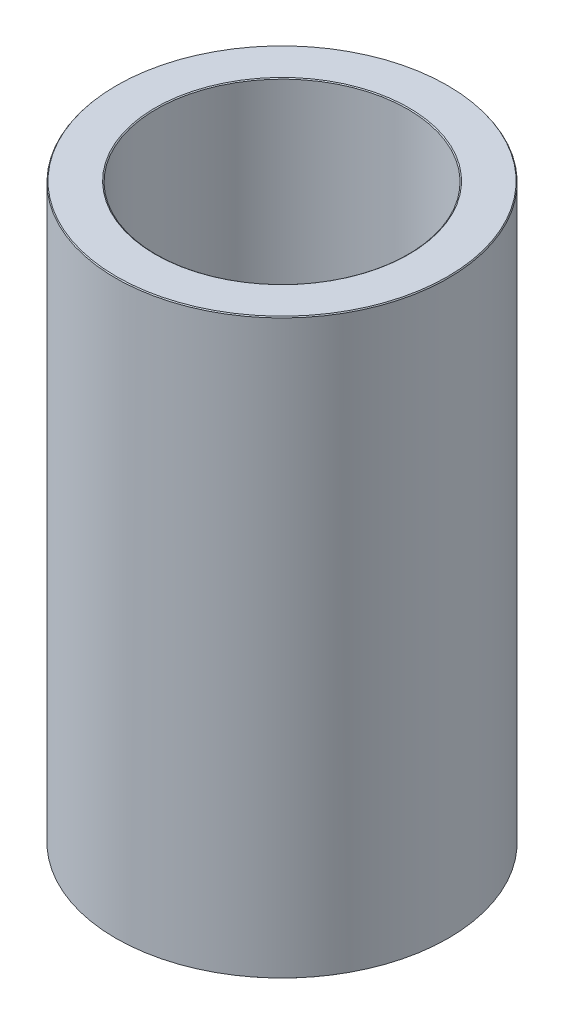
ISO-10303-21;
HEADER;
FILE_DESCRIPTION(('STEP AP214'),'2;1');
FILE_NAME('part.step','',(''),(''),'','','');
FILE_SCHEMA(('AUTOMOTIVE_DESIGN { 1 0 10303 214 1 1 1 1 }'));
ENDSEC;
DATA;
#1=APPLICATION_CONTEXT('core data for automotive mechanical design processes');
#2=APPLICATION_PROTOCOL_DEFINITION('international standard','automotive_design',2000,#1);
#3=PRODUCT_CONTEXT('',#1,'mechanical');
#4=PRODUCT('Part','Part','',(#3));
#5=PRODUCT_RELATED_PRODUCT_CATEGORY('part','',(#4));
#6=PRODUCT_DEFINITION_FORMATION('','',#4);
#7=PRODUCT_DEFINITION_CONTEXT('part definition',#1,'design');
#8=PRODUCT_DEFINITION('design','',#6,#7);
#9=PRODUCT_DEFINITION_SHAPE('','',#8);
#10=(LENGTH_UNIT() NAMED_UNIT(*) SI_UNIT(.MILLI.,.METRE.));
#11=(NAMED_UNIT(*) PLANE_ANGLE_UNIT() SI_UNIT($,.RADIAN.));
#12=(NAMED_UNIT(*) SI_UNIT($,.STERADIAN.) SOLID_ANGLE_UNIT());
#13=UNCERTAINTY_MEASURE_WITH_UNIT(LENGTH_MEASURE(1.E-05),#10,'distance_accuracy_value','');
#14=(GEOMETRIC_REPRESENTATION_CONTEXT(3) GLOBAL_UNCERTAINTY_ASSIGNED_CONTEXT((#13)) GLOBAL_UNIT_ASSIGNED_CONTEXT((#10,
#11,#12)) REPRESENTATION_CONTEXT('',''));
#15=CARTESIAN_POINT('',(0.,0.,0.));
#16=DIRECTION('',(0.,0.,1.));
#17=DIRECTION('',(1.,0.,0.));
#18=AXIS2_PLACEMENT_3D('',#15,#16,#17);
#19=CARTESIAN_POINT('',(0.,198.304315310757,0.));
#20=DIRECTION('',(0.,-1.,0.));
#21=DIRECTION('',(0.,0.,-1.));
#22=AXIS2_PLACEMENT_3D('',#19,#20,#21);
#23=CYLINDRICAL_SURFACE('',#22,57.5);
#24=CARTESIAN_POINT('',(0.,0.254148228722828,0.));
#25=DIRECTION('',(0.,1.,0.));
#26=DIRECTION('',(0.,0.,1.));
#27=AXIS2_PLACEMENT_3D('',#24,#25,#26);
#28=CIRCLE('',#27,57.5);
#29=CARTESIAN_POINT('',(0.,0.2541482287228,-57.5));
#30=VERTEX_POINT('',#29);
#31=EDGE_CURVE('E10',#30,#30,#28,.T.);
#32=CARTESIAN_POINT('',(0.,197.946111651441,0.));
#33=DIRECTION('',(0.,1.,0.));
#34=DIRECTION('',(0.,0.,1.));
#35=AXIS2_PLACEMENT_3D('',#32,#33,#34);
#36=CIRCLE('',#35,57.5);
#37=CARTESIAN_POINT('',(0.,197.946111651441,-57.5));
#38=VERTEX_POINT('',#37);
#39=EDGE_CURVE('E50',#38,#38,#36,.F.);
#40=CARTESIAN_POINT('',(0.,0.2541482287228,-57.5));
#41=CARTESIAN_POINT('',(0.,2.3134395143761,-57.5));
#42=CARTESIAN_POINT('',(0.,4.37273080002941,-57.5));
#43=CARTESIAN_POINT('',(0.,8.49131337133604,-57.5));
#44=CARTESIAN_POINT('',(0.,10.5506046569894,-57.5));
#45=CARTESIAN_POINT('',(0.,14.669187228296,-57.5));
#46=CARTESIAN_POINT('',(0.,16.7284785139493,-57.5));
#47=CARTESIAN_POINT('',(0.,20.8470610852559,-57.5));
#48=CARTESIAN_POINT('',(0.,22.9063523709092,-57.5));
#49=CARTESIAN_POINT('',(0.,27.0249349422158,-57.5));
#50=CARTESIAN_POINT('',(0.,29.0842262278691,-57.5));
#51=CARTESIAN_POINT('',(0.,33.2028087991758,-57.5));
#52=CARTESIAN_POINT('',(0.,35.2621000848291,-57.5));
#53=CARTESIAN_POINT('',(0.,39.3806826561357,-57.5));
#54=CARTESIAN_POINT('',(0.,41.439973941789,-57.5));
#55=CARTESIAN_POINT('',(0.,45.5585565130956,-57.5));
#56=CARTESIAN_POINT('',(0.,47.6178477987489,-57.5));
#57=CARTESIAN_POINT('',(0.,51.7364303700556,-57.5));
#58=CARTESIAN_POINT('',(0.,53.7957216557089,-57.5));
#59=CARTESIAN_POINT('',(0.,57.9143042270155,-57.5));
#60=CARTESIAN_POINT('',(0.,59.9735955126688,-57.5));
#61=CARTESIAN_POINT('',(0.,64.0921780839754,-57.5));
#62=CARTESIAN_POINT('',(0.,66.1514693696287,-57.5));
#63=CARTESIAN_POINT('',(0.,70.2700519409353,-57.5));
#64=CARTESIAN_POINT('',(0.,72.3293432265886,-57.5));
#65=CARTESIAN_POINT('',(0.,76.4479257978953,-57.5));
#66=CARTESIAN_POINT('',(0.,78.5072170835486,-57.5));
#67=CARTESIAN_POINT('',(0.,82.6257996548552,-57.5));
#68=CARTESIAN_POINT('',(0.,84.6850909405085,-57.5));
#69=CARTESIAN_POINT('',(0.,88.8036735118151,-57.5));
#70=CARTESIAN_POINT('',(0.,90.8629647974684,-57.5));
#71=CARTESIAN_POINT('',(0.,94.981547368775,-57.5));
#72=CARTESIAN_POINT('',(0.,97.0408386544284,-57.5));
#73=CARTESIAN_POINT('',(0.,101.159421225735,-57.5));
#74=CARTESIAN_POINT('',(0.,103.218712511388,-57.5));
#75=CARTESIAN_POINT('',(0.,107.337295082695,-57.5));
#76=CARTESIAN_POINT('',(0.,109.396586368348,-57.5));
#77=CARTESIAN_POINT('',(0.,113.515168939655,-57.5));
#78=CARTESIAN_POINT('',(0.,115.574460225308,-57.5));
#79=CARTESIAN_POINT('',(0.,119.693042796615,-57.5));
#80=CARTESIAN_POINT('',(0.,121.752334082268,-57.5));
#81=CARTESIAN_POINT('',(0.,125.870916653575,-57.5));
#82=CARTESIAN_POINT('',(0.,127.930207939228,-57.5));
#83=CARTESIAN_POINT('',(0.,132.048790510535,-57.5));
#84=CARTESIAN_POINT('',(0.,134.108081796188,-57.5));
#85=CARTESIAN_POINT('',(0.,138.226664367495,-57.5));
#86=CARTESIAN_POINT('',(0.,140.285955653148,-57.5));
#87=CARTESIAN_POINT('',(0.,144.404538224454,-57.5));
#88=CARTESIAN_POINT('',(0.,146.463829510108,-57.5));
#89=CARTESIAN_POINT('',(0.,150.582412081414,-57.5));
#90=CARTESIAN_POINT('',(0.,152.641703367068,-57.5));
#91=CARTESIAN_POINT('',(0.,156.760285938374,-57.5));
#92=CARTESIAN_POINT('',(0.,158.819577224028,-57.5));
#93=CARTESIAN_POINT('',(0.,162.938159795334,-57.5));
#94=CARTESIAN_POINT('',(0.,164.997451080988,-57.5));
#95=CARTESIAN_POINT('',(0.,169.116033652294,-57.5));
#96=CARTESIAN_POINT('',(0.,171.175324937947,-57.5));
#97=CARTESIAN_POINT('',(0.,175.293907509254,-57.5));
#98=CARTESIAN_POINT('',(0.,177.353198794907,-57.5));
#99=CARTESIAN_POINT('',(0.,181.471781366214,-57.5));
#100=CARTESIAN_POINT('',(0.,183.531072651867,-57.5));
#101=CARTESIAN_POINT('',(0.,187.649655223174,-57.5));
#102=CARTESIAN_POINT('',(0.,189.708946508827,-57.5));
#103=CARTESIAN_POINT('',(0.,193.827529080134,-57.5));
#104=CARTESIAN_POINT('',(0.,195.886820365787,-57.5));
#105=CARTESIAN_POINT('',(0.,197.946111651441,-57.5));
#106=B_SPLINE_CURVE_WITH_KNOTS('',3,(#40,#41,#42,#43,#44,#45,#46,#47,#48,#49,#50,#51,#52,#53,
#54,#55,#56,#57,#58,#59,#60,#61,#62,#63,#64,#65,#66,#67,#68,#69,#70,#71,#72,#73,#74,#75,#76,#77,
#78,#79,#80,#81,#82,#83,#84,#85,#86,#87,#88,#89,#90,#91,#92,#93,#94,#95,#96,#97,#98,#99,#100,
#101,#102,#103,#104,#105),.UNSPECIFIED.,.F.,.F.,(4,2,2,2,2,2,2,2,2,2,2,2,2,2,2,2,2,2,2,2,2,2,2,
2,2,2,2,2,2,2,2,2,4),(0.,6.17787385695992,12.3557477139199,18.5336215708798,24.7114954278397,
30.8893692847997,37.0672431417596,43.2451169987195,49.4229908556794,55.6008647126394,
61.7787385695993,67.9566124265592,74.1344862835191,80.3123601404791,86.490233997439,
92.6681078543989,98.8459817113589,105.023855568319,111.201729425279,117.379603282239,
123.557477139199,129.735350996159,135.913224853118,142.091098710078,148.268972567038,
154.446846423998,160.624720280958,166.802594137918,172.980467994878,179.158341851838,
185.336215708798,191.514089565758,197.691963422718),.UNSPECIFIED.);
#107=EDGE_CURVE('BSEAM39',#30,#38,#106,.T.);
#108=ORIENTED_EDGE('',*,*,#31,.T.);
#109=ORIENTED_EDGE('',*,*,#39,.T.);
#110=ORIENTED_EDGE('',*,*,#107,.T.);
#111=ORIENTED_EDGE('',*,*,#107,.F.);
#112=EDGE_LOOP('',(#108,#110,#109,#111));
#113=FACE_BOUND('',#112,.T.);
#114=ADVANCED_FACE('F39',(#113),#23,.T.);
#115=CARTESIAN_POINT('',(0.,198.304315310757,0.));
#116=DIRECTION('',(0.,1.,0.));
#117=DIRECTION('',(0.,0.,1.));
#118=AXIS2_PLACEMENT_3D('',#115,#116,#117);
#119=PLANE('',#118);
#120=CARTESIAN_POINT('',(0.,198.304315310757,0.));
#121=DIRECTION('',(0.,1.,0.));
#122=DIRECTION('',(0.,0.,1.));
#123=AXIS2_PLACEMENT_3D('',#120,#121,#122);
#124=CIRCLE('',#123,43.8921766385221);
#125=CARTESIAN_POINT('',(0.,198.304315310757,43.8921766385221));
#126=VERTEX_POINT('',#125);
#127=EDGE_CURVE('E58',#126,#126,#124,.F.);
#128=ORIENTED_EDGE('',*,*,#127,.T.);
#129=EDGE_LOOP('',(#128));
#130=FACE_BOUND('',#129,.T.);
#131=CARTESIAN_POINT('',(0.,198.304315310757,0.));
#132=DIRECTION('',(0.,1.,0.));
#133=DIRECTION('',(0.,0.,1.));
#134=AXIS2_PLACEMENT_3D('',#131,#132,#133);
#135=CIRCLE('',#134,57.2458517712774);
#136=CARTESIAN_POINT('',(0.,198.304315310757,57.2458517712774));
#137=VERTEX_POINT('',#136);
#138=EDGE_CURVE('E61',#137,#137,#135,.T.);
#139=ORIENTED_EDGE('',*,*,#138,.T.);
#140=EDGE_LOOP('',(#139));
#141=FACE_BOUND('',#140,.T.);
#142=ADVANCED_FACE('F88',(#130,#141),#119,.T.);
#143=CARTESIAN_POINT('',(0.,0.,0.));
#144=DIRECTION('',(0.,1.,0.));
#145=DIRECTION('',(0.,0.,1.));
#146=AXIS2_PLACEMENT_3D('',#143,#144,#145);
#147=PLANE('',#146);
#148=CARTESIAN_POINT('',(0.,0.,0.));
#149=DIRECTION('',(0.,1.,0.));
#150=DIRECTION('',(0.,0.,1.));
#151=AXIS2_PLACEMENT_3D('',#148,#149,#150);
#152=CIRCLE('',#151,43.7881212079286);
#153=CARTESIAN_POINT('',(0.,0.,43.7881212079286));
#154=VERTEX_POINT('',#153);
#155=EDGE_CURVE('E51',#154,#154,#152,.T.);
#156=ORIENTED_EDGE('',*,*,#155,.T.);
#157=EDGE_LOOP('',(#156));
#158=FACE_BOUND('',#157,.T.);
#159=CARTESIAN_POINT('',(0.,0.,0.));
#160=DIRECTION('',(0.,1.,0.));
#161=DIRECTION('',(0.,0.,1.));
#162=AXIS2_PLACEMENT_3D('',#159,#160,#161);
#163=CIRCLE('',#162,57.1417963406838);
#164=CARTESIAN_POINT('',(0.,0.,57.1417963406838));
#165=VERTEX_POINT('',#164);
#166=EDGE_CURVE('E54',#165,#165,#163,.F.);
#167=ORIENTED_EDGE('',*,*,#166,.T.);
#168=EDGE_LOOP('',(#167));
#169=FACE_BOUND('',#168,.T.);
#170=ADVANCED_FACE('F83',(#158,#169),#147,.F.);
#171=CARTESIAN_POINT('',(0.,198.304315310757,0.));
#172=DIRECTION('',(0.,-1.,0.));
#173=DIRECTION('',(0.,0.,-1.));
#174=AXIS2_PLACEMENT_3D('',#171,#172,#173);
#175=CYLINDRICAL_SURFACE('',#174,43.5339729792059);
#176=CARTESIAN_POINT('',(0.,198.050167082034,0.));
#177=DIRECTION('',(0.,1.,0.));
#178=DIRECTION('',(0.,0.,1.));
#179=AXIS2_PLACEMENT_3D('',#176,#177,#178);
#180=CIRCLE('',#179,43.5339729792059);
#181=CARTESIAN_POINT('',(0.,198.050167082034,-43.5339729792059));
#182=VERTEX_POINT('',#181);
#183=EDGE_CURVE('E67',#182,#182,#180,.T.);
#184=CARTESIAN_POINT('',(0.,0.358203659316103,0.));
#185=DIRECTION('',(0.,1.,0.));
#186=DIRECTION('',(0.,0.,1.));
#187=AXIS2_PLACEMENT_3D('',#184,#185,#186);
#188=CIRCLE('',#187,43.5339729792059);
#189=CARTESIAN_POINT('',(0.,0.358203659316075,-43.5339729792059));
#190=VERTEX_POINT('',#189);
#191=EDGE_CURVE('E69',#190,#190,#188,.F.);
#192=CARTESIAN_POINT('',(0.,198.050167082034,-43.5339729792059));
#193=CARTESIAN_POINT('',(0.,195.99087579638,-43.5339729792059));
#194=CARTESIAN_POINT('',(0.,193.931584510727,-43.5339729792059));
#195=CARTESIAN_POINT('',(0.,189.81300193942,-43.5339729792059));
#196=CARTESIAN_POINT('',(0.,187.753710653767,-43.5339729792059));
#197=CARTESIAN_POINT('',(0.,183.635128082461,-43.5339729792059));
#198=CARTESIAN_POINT('',(0.,181.575836796807,-43.5339729792059));
#199=CARTESIAN_POINT('',(0.,177.457254225501,-43.5339729792059));
#200=CARTESIAN_POINT('',(0.,175.397962939847,-43.5339729792059));
#201=CARTESIAN_POINT('',(0.,171.279380368541,-43.5339729792059));
#202=CARTESIAN_POINT('',(0.,169.220089082887,-43.5339729792059));
#203=CARTESIAN_POINT('',(0.,165.101506511581,-43.5339729792059));
#204=CARTESIAN_POINT('',(0.,163.042215225927,-43.5339729792059));
#205=CARTESIAN_POINT('',(0.,158.923632654621,-43.5339729792059));
#206=CARTESIAN_POINT('',(0.,156.864341368968,-43.5339729792059));
#207=CARTESIAN_POINT('',(0.,152.745758797661,-43.5339729792059));
#208=CARTESIAN_POINT('',(0.,150.686467512008,-43.5339729792059));
#209=CARTESIAN_POINT('',(0.,146.567884940701,-43.5339729792059));
#210=CARTESIAN_POINT('',(0.,144.508593655048,-43.5339729792059));
#211=CARTESIAN_POINT('',(0.,140.390011083741,-43.5339729792059));
#212=CARTESIAN_POINT('',(0.,138.330719798088,-43.5339729792059));
#213=CARTESIAN_POINT('',(0.,134.212137226781,-43.5339729792059));
#214=CARTESIAN_POINT('',(0.,132.152845941128,-43.5339729792059));
#215=CARTESIAN_POINT('',(0.,128.034263369821,-43.5339729792059));
#216=CARTESIAN_POINT('',(0.,125.974972084168,-43.5339729792059));
#217=CARTESIAN_POINT('',(0.,121.856389512861,-43.5339729792059));
#218=CARTESIAN_POINT('',(0.,119.797098227208,-43.5339729792059));
#219=CARTESIAN_POINT('',(0.,115.678515655901,-43.5339729792059));
#220=CARTESIAN_POINT('',(0.,113.619224370248,-43.5339729792059));
#221=CARTESIAN_POINT('',(0.,109.500641798941,-43.5339729792059));
#222=CARTESIAN_POINT('',(0.,107.441350513288,-43.5339729792059));
#223=CARTESIAN_POINT('',(0.,103.322767941981,-43.5339729792059));
#224=CARTESIAN_POINT('',(0.,101.263476656328,-43.5339729792059));
#225=CARTESIAN_POINT('',(0.,97.1448940850216,-43.5339729792059));
#226=CARTESIAN_POINT('',(0.,95.0856027993683,-43.5339729792059));
#227=CARTESIAN_POINT('',(0.,90.9670202280616,-43.5339729792059));
#228=CARTESIAN_POINT('',(0.,88.9077289424083,-43.5339729792059));
#229=CARTESIAN_POINT('',(0.,84.7891463711017,-43.5339729792059));
#230=CARTESIAN_POINT('',(0.,82.7298550854484,-43.5339729792059));
#231=CARTESIAN_POINT('',(0.,78.6112725141418,-43.5339729792059));
#232=CARTESIAN_POINT('',(0.,76.5519812284885,-43.5339729792059));
#233=CARTESIAN_POINT('',(0.,72.4333986571819,-43.5339729792059));
#234=CARTESIAN_POINT('',(0.,70.3741073715286,-43.5339729792059));
#235=CARTESIAN_POINT('',(0.,66.255524800222,-43.5339729792059));
#236=CARTESIAN_POINT('',(0.,64.1962335145686,-43.5339729792059));
#237=CARTESIAN_POINT('',(0.,60.077650943262,-43.5339729792059));
#238=CARTESIAN_POINT('',(0.,58.0183596576087,-43.5339729792059));
#239=CARTESIAN_POINT('',(0.,53.8997770863021,-43.5339729792059));
#240=CARTESIAN_POINT('',(0.,51.8404858006488,-43.5339729792059));
#241=CARTESIAN_POINT('',(0.,47.7219032293422,-43.5339729792059));
#242=CARTESIAN_POINT('',(0.,45.6626119436889,-43.5339729792059));
#243=CARTESIAN_POINT('',(0.,41.5440293723822,-43.5339729792059));
#244=CARTESIAN_POINT('',(0.,39.4847380867289,-43.5339729792059));
#245=CARTESIAN_POINT('',(0.,35.3661555154223,-43.5339729792059));
#246=CARTESIAN_POINT('',(0.,33.306864229769,-43.5339729792059));
#247=CARTESIAN_POINT('',(0.,29.1882816584624,-43.5339729792059));
#248=CARTESIAN_POINT('',(0.,27.1289903728091,-43.5339729792059));
#249=CARTESIAN_POINT('',(0.,23.0104078015025,-43.5339729792059));
#250=CARTESIAN_POINT('',(0.,20.9511165158492,-43.5339729792059));
#251=CARTESIAN_POINT('',(0.,16.8325339445425,-43.5339729792059));
#252=CARTESIAN_POINT('',(0.,14.7732426588892,-43.5339729792059));
#253=CARTESIAN_POINT('',(0.,10.6546600875826,-43.5339729792059));
#254=CARTESIAN_POINT('',(0.,8.59536880192932,-43.5339729792059));
#255=CARTESIAN_POINT('',(0.,4.47678623062271,-43.5339729792059));
#256=CARTESIAN_POINT('',(0.,2.41749494496939,-43.5339729792059));
#257=CARTESIAN_POINT('',(0.,0.358203659316075,-43.5339729792059));
#258=B_SPLINE_CURVE_WITH_KNOTS('',3,(#192,#193,#194,#195,#196,#197,#198,#199,#200,#201,#202,
#203,#204,#205,#206,#207,#208,#209,#210,#211,#212,#213,#214,#215,#216,#217,#218,#219,#220,#221,
#222,#223,#224,#225,#226,#227,#228,#229,#230,#231,#232,#233,#234,#235,#236,#237,#238,#239,#240,
#241,#242,#243,#244,#245,#246,#247,#248,#249,#250,#251,#252,#253,#254,#255,#256,#257),
.UNSPECIFIED.,.F.,.F.,(4,2,2,2,2,2,2,2,2,2,2,2,2,2,2,2,2,2,2,2,2,2,2,2,2,2,2,2,2,2,2,2,4),(0.,
6.17787385695995,12.3557477139199,18.5336215708798,24.7114954278397,30.8893692847996,
37.0672431417595,43.2451169987195,49.4229908556794,55.6008647126393,61.7787385695993,
67.9566124265592,74.1344862835191,80.312360140479,86.4902339974389,92.6681078543989,
98.8459817113588,105.023855568319,111.201729425279,117.379603282239,123.557477139199,
129.735350996158,135.913224853118,142.091098710078,148.268972567038,154.446846423998,
160.624720280958,166.802594137918,172.980467994878,179.158341851838,185.336215708798,
191.514089565758,197.691963422718),.UNSPECIFIED.);
#259=EDGE_CURVE('BSEAM71',#182,#190,#258,.T.);
#260=ORIENTED_EDGE('',*,*,#183,.T.);
#261=ORIENTED_EDGE('',*,*,#191,.T.);
#262=ORIENTED_EDGE('',*,*,#259,.T.);
#263=ORIENTED_EDGE('',*,*,#259,.F.);
#264=EDGE_LOOP('',(#260,#262,#261,#263));
#265=FACE_BOUND('',#264,.T.);
#266=ADVANCED_FACE('F71',(#265),#175,.F.);
#267=CARTESIAN_POINT('',(0.,198.050167082034,0.));
#268=DIRECTION('',(0.,1.,0.));
#269=DIRECTION('',(0.,0.,1.));
#270=AXIS2_PLACEMENT_3D('',#267,#268,#269);
#271=CONICAL_SURFACE('',#270,43.5339729792059,0.953717864255243);
#272=ORIENTED_EDGE('',*,*,#127,.F.);
#273=EDGE_LOOP('',(#272));
#274=FACE_BOUND('',#273,.T.);
#275=ORIENTED_EDGE('',*,*,#183,.F.);
#276=EDGE_LOOP('',(#275));
#277=FACE_BOUND('',#276,.T.);
#278=ADVANCED_FACE('F77',(#274,#277),#271,.F.);
#279=CARTESIAN_POINT('',(0.,0.,0.));
#280=DIRECTION('',(0.,-1.,0.));
#281=DIRECTION('',(0.,0.,-1.));
#282=AXIS2_PLACEMENT_3D('',#279,#280,#281);
#283=CONICAL_SURFACE('',#282,43.7881212079286,0.617078462539619);
#284=ORIENTED_EDGE('',*,*,#191,.F.);
#285=EDGE_LOOP('',(#284));
#286=FACE_BOUND('',#285,.T.);
#287=ORIENTED_EDGE('',*,*,#155,.F.);
#288=EDGE_LOOP('',(#287));
#289=FACE_BOUND('',#288,.T.);
#290=ADVANCED_FACE('F73',(#286,#289),#283,.F.);
#291=CARTESIAN_POINT('',(0.,0.254148228722828,0.));
#292=DIRECTION('',(0.,1.,0.));
#293=DIRECTION('',(0.,0.,1.));
#294=AXIS2_PLACEMENT_3D('',#291,#292,#293);
#295=CONICAL_SURFACE('',#294,57.5,0.95371786425524);
#296=ORIENTED_EDGE('',*,*,#166,.F.);
#297=EDGE_LOOP('',(#296));
#298=FACE_BOUND('',#297,.T.);
#299=ORIENTED_EDGE('',*,*,#31,.F.);
#300=EDGE_LOOP('',(#299));
#301=FACE_BOUND('',#300,.T.);
#302=ADVANCED_FACE('F76',(#298,#301),#295,.T.);
#303=CARTESIAN_POINT('',(0.,198.304315310757,0.));
#304=DIRECTION('',(0.,-1.,0.));
#305=DIRECTION('',(0.,0.,-1.));
#306=AXIS2_PLACEMENT_3D('',#303,#304,#305);
#307=CONICAL_SURFACE('',#306,57.2458517712774,0.617078462539585);
#308=ORIENTED_EDGE('',*,*,#39,.F.);
#309=EDGE_LOOP('',(#308));
#310=FACE_BOUND('',#309,.T.);
#311=ORIENTED_EDGE('',*,*,#138,.F.);
#312=EDGE_LOOP('',(#311));
#313=FACE_BOUND('',#312,.T.);
#314=ADVANCED_FACE('F45',(#310,#313),#307,.T.);
#315=CLOSED_SHELL('',(#114,#142,#170,#266,#278,#290,#302,#314));
#316=MANIFOLD_SOLID_BREP('B2',#315);
#317=ADVANCED_BREP_SHAPE_REPRESENTATION('',(#18,#316),#14);
#318=SHAPE_DEFINITION_REPRESENTATION(#9,#317);
ENDSEC;
END-ISO-10303-21;
